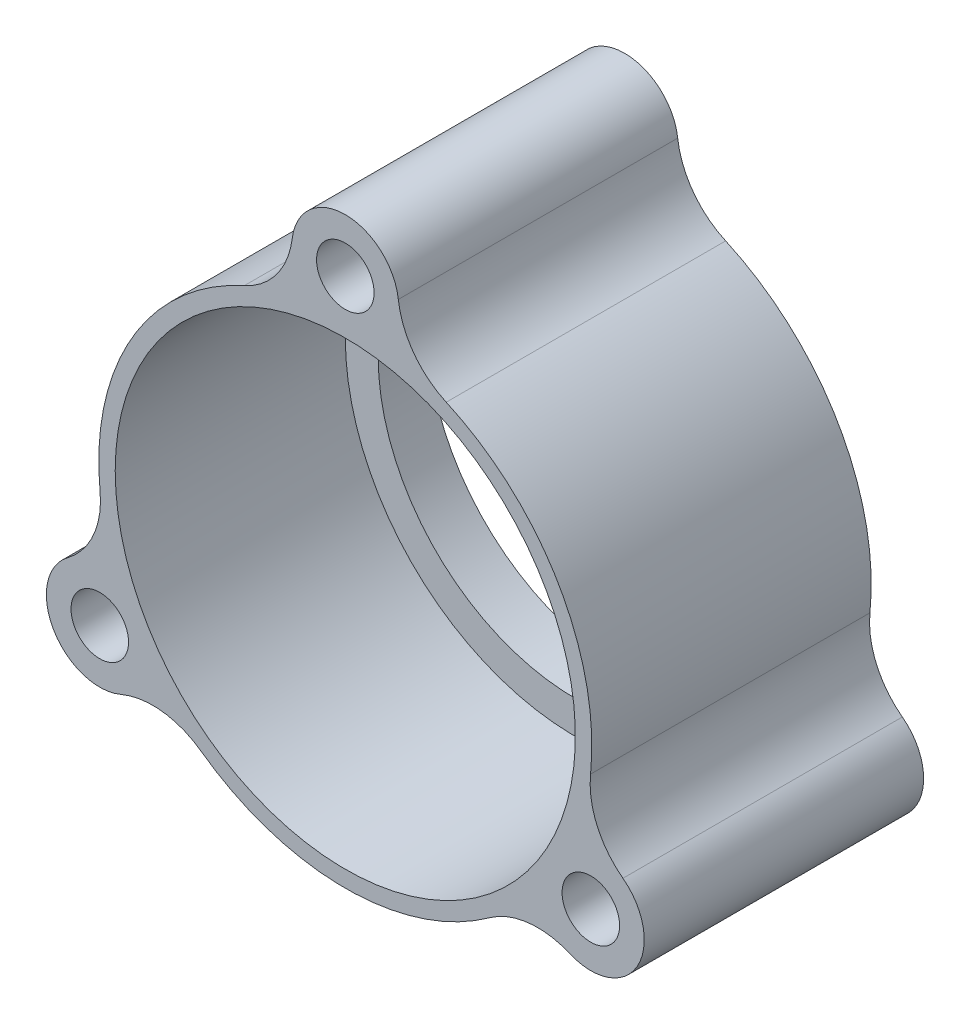
ISO-10303-21;
HEADER;
FILE_DESCRIPTION(('STEP AP214'),'2;1');
FILE_NAME('part.step','',(''),(''),'','','');
FILE_SCHEMA(('AUTOMOTIVE_DESIGN { 1 0 10303 214 1 1 1 1 }'));
ENDSEC;
DATA;
#1=APPLICATION_CONTEXT('core data for automotive mechanical design processes');
#2=APPLICATION_PROTOCOL_DEFINITION('international standard','automotive_design',2000,#1);
#3=PRODUCT_CONTEXT('',#1,'mechanical');
#4=PRODUCT('Part','Part','',(#3));
#5=PRODUCT_RELATED_PRODUCT_CATEGORY('part','',(#4));
#6=PRODUCT_DEFINITION_FORMATION('','',#4);
#7=PRODUCT_DEFINITION_CONTEXT('part definition',#1,'design');
#8=PRODUCT_DEFINITION('design','',#6,#7);
#9=PRODUCT_DEFINITION_SHAPE('','',#8);
#10=(LENGTH_UNIT() NAMED_UNIT(*) SI_UNIT(.MILLI.,.METRE.));
#11=(NAMED_UNIT(*) PLANE_ANGLE_UNIT() SI_UNIT($,.RADIAN.));
#12=(NAMED_UNIT(*) SI_UNIT($,.STERADIAN.) SOLID_ANGLE_UNIT());
#13=UNCERTAINTY_MEASURE_WITH_UNIT(LENGTH_MEASURE(1.E-05),#10,'distance_accuracy_value','');
#14=(GEOMETRIC_REPRESENTATION_CONTEXT(3) GLOBAL_UNCERTAINTY_ASSIGNED_CONTEXT((#13)) GLOBAL_UNIT_ASSIGNED_CONTEXT((#10,
#11,#12)) REPRESENTATION_CONTEXT('',''));
#15=CARTESIAN_POINT('',(0.,0.,0.));
#16=DIRECTION('',(0.,0.,1.));
#17=DIRECTION('',(1.,0.,0.));
#18=AXIS2_PLACEMENT_3D('',#15,#16,#17);
#19=CARTESIAN_POINT('',(0.,0.,14.));
#20=DIRECTION('',(0.,0.,-1.));
#21=DIRECTION('',(-1.,0.,0.));
#22=AXIS2_PLACEMENT_3D('',#19,#20,#21);
#23=CYLINDRICAL_SURFACE('',#22,15.);
#24=CARTESIAN_POINT('',(0.,0.,-3.));
#25=DIRECTION('',(0.,0.,-1.));
#26=DIRECTION('',(-1.,0.,0.));
#27=AXIS2_PLACEMENT_3D('',#24,#25,#26);
#28=CIRCLE('',#27,15.);
#29=CARTESIAN_POINT('',(-14.9224736219948,-1.52308272948988,-3.));
#30=VERTEX_POINT('',#29);
#31=CARTESIAN_POINT('',(-6.14220847519368,13.6847826086957,-3.));
#32=VERTEX_POINT('',#31);
#33=EDGE_CURVE('E147',#30,#32,#28,.T.);
#34=ORIENTED_EDGE('',*,*,#33,.F.);
#35=DIRECTION('',(0.,0.,-1.));
#36=VECTOR('',#35,1.);
#37=CARTESIAN_POINT('',(-14.9224736219948,-1.52308272948988,14.));
#38=LINE('',#37,#36);
#39=CARTESIAN_POINT('',(-14.9224736219948,-1.52308272948988,14.));
#40=VERTEX_POINT('',#39);
#41=EDGE_CURVE('E181',#30,#40,#38,.F.);
#42=ORIENTED_EDGE('',*,*,#41,.T.);
#43=CARTESIAN_POINT('',(0.,0.,14.));
#44=DIRECTION('',(0.,0.,1.));
#45=DIRECTION('',(1.,0.,0.));
#46=AXIS2_PLACEMENT_3D('',#43,#44,#45);
#47=CIRCLE('',#46,15.);
#48=CARTESIAN_POINT('',(-6.14220847519368,13.6847826086957,14.));
#49=VERTEX_POINT('',#48);
#50=EDGE_CURVE('E156',#49,#40,#47,.T.);
#51=ORIENTED_EDGE('',*,*,#50,.F.);
#52=DIRECTION('',(0.,0.,-1.));
#53=VECTOR('',#52,1.);
#54=CARTESIAN_POINT('',(-6.14220847519368,13.6847826086957,14.));
#55=LINE('',#54,#53);
#56=EDGE_CURVE('E151',#49,#32,#55,.T.);
#57=ORIENTED_EDGE('',*,*,#56,.T.);
#58=EDGE_LOOP('',(#34,#42,#51,#57));
#59=FACE_BOUND('',#58,.T.);
#60=ADVANCED_FACE('F33',(#59),#23,.T.);
#61=CARTESIAN_POINT('',(-8.78026514680119,-12.1616998792055,14.));
#62=VERTEX_POINT('',#61);
#63=CARTESIAN_POINT('',(8.78026514680102,-12.1616998792057,14.));
#64=VERTEX_POINT('',#63);
#65=EDGE_CURVE('E208',#62,#64,#47,.T.);
#66=ORIENTED_EDGE('',*,*,#65,.F.);
#67=DIRECTION('',(0.,0.,-1.));
#68=VECTOR('',#67,1.);
#69=CARTESIAN_POINT('',(-8.78026514680119,-12.1616998792055,14.));
#70=LINE('',#69,#68);
#71=CARTESIAN_POINT('',(-8.78026514680119,-12.1616998792055,-3.));
#72=VERTEX_POINT('',#71);
#73=EDGE_CURVE('E188',#62,#72,#70,.T.);
#74=ORIENTED_EDGE('',*,*,#73,.T.);
#75=CARTESIAN_POINT('',(8.78026514680102,-12.1616998792057,-3.));
#76=VERTEX_POINT('',#75);
#77=EDGE_CURVE('E145',#76,#72,#28,.T.);
#78=ORIENTED_EDGE('',*,*,#77,.F.);
#79=DIRECTION('',(0.,0.,-1.));
#80=VECTOR('',#79,1.);
#81=CARTESIAN_POINT('',(8.78026514680102,-12.1616998792057,14.));
#82=LINE('',#81,#80);
#83=EDGE_CURVE('E165',#76,#64,#82,.F.);
#84=ORIENTED_EDGE('',*,*,#83,.T.);
#85=EDGE_LOOP('',(#66,#74,#78,#84));
#86=FACE_BOUND('',#85,.T.);
#87=ADVANCED_FACE('F206',(#86),#23,.T.);
#88=CARTESIAN_POINT('',(14.9224736219947,-1.52308272949009,14.));
#89=VERTEX_POINT('',#88);
#90=CARTESIAN_POINT('',(6.14220847519368,13.6847826086957,14.));
#91=VERTEX_POINT('',#90);
#92=EDGE_CURVE('E210',#89,#91,#47,.T.);
#93=ORIENTED_EDGE('',*,*,#92,.F.);
#94=DIRECTION('',(0.,0.,-1.));
#95=VECTOR('',#94,1.);
#96=CARTESIAN_POINT('',(14.9224736219947,-1.52308272949009,14.));
#97=LINE('',#96,#95);
#98=CARTESIAN_POINT('',(14.9224736219947,-1.52308272949009,-3.));
#99=VERTEX_POINT('',#98);
#100=EDGE_CURVE('E143',#89,#99,#97,.T.);
#101=ORIENTED_EDGE('',*,*,#100,.T.);
#102=CARTESIAN_POINT('',(6.14220847519368,13.6847826086957,-3.));
#103=VERTEX_POINT('',#102);
#104=EDGE_CURVE('E127',#103,#99,#28,.T.);
#105=ORIENTED_EDGE('',*,*,#104,.F.);
#106=DIRECTION('',(0.,0.,-1.));
#107=VECTOR('',#106,1.);
#108=CARTESIAN_POINT('',(6.14220847519368,13.6847826086957,14.));
#109=LINE('',#108,#107);
#110=EDGE_CURVE('E141',#103,#91,#109,.F.);
#111=ORIENTED_EDGE('',*,*,#110,.T.);
#112=EDGE_LOOP('',(#93,#101,#105,#111));
#113=FACE_BOUND('',#112,.T.);
#114=ADVANCED_FACE('F140',(#113),#23,.T.);
#115=CARTESIAN_POINT('',(0.,0.,14.));
#116=DIRECTION('',(0.,0.,1.));
#117=DIRECTION('',(1.,0.,0.));
#118=AXIS2_PLACEMENT_3D('',#115,#116,#117);
#119=PLANE('',#118);
#120=ORIENTED_EDGE('',*,*,#50,.T.);
#121=CARTESIAN_POINT('',(-19.896631495993,-2.03077697265318,14.));
#122=DIRECTION('',(0.,0.,1.));
#123=DIRECTION('',(1.,0.,0.));
#124=AXIS2_PLACEMENT_3D('',#121,#122,#123);
#125=CIRCLE('',#124,5.);
#126=CARTESIAN_POINT('',(-16.8919689016225,-6.02727577710571,14.));
#127=VERTEX_POINT('',#126);
#128=EDGE_CURVE('E190',#40,#127,#125,.F.);
#129=ORIENTED_EDGE('',*,*,#128,.T.);
#130=CARTESIAN_POINT('',(-14.9389382152816,-8.62499999999986,14.));
#131=DIRECTION('',(0.,0.,1.));
#132=DIRECTION('',(-0.499999999999992,0.866025403784443,0.));
#133=AXIS2_PLACEMENT_3D('',#130,#131,#132);
#134=CIRCLE('',#133,3.25);
#135=CARTESIAN_POINT('',(-13.6657583893996,-11.6152363001887,14.));
#136=VERTEX_POINT('',#135);
#137=EDGE_CURVE('E249',#127,#136,#134,.T.);
#138=ORIENTED_EDGE('',*,*,#137,.T.);
#139=CARTESIAN_POINT('',(-11.7070201957349,-16.2155998389407,14.));
#140=DIRECTION('',(0.,0.,1.));
#141=DIRECTION('',(1.,0.,0.));
#142=AXIS2_PLACEMENT_3D('',#139,#140,#141);
#143=CIRCLE('',#142,5.);
#144=EDGE_CURVE('E11',#136,#62,#143,.F.);
#145=ORIENTED_EDGE('',*,*,#144,.T.);
#146=ORIENTED_EDGE('',*,*,#65,.T.);
#147=CARTESIAN_POINT('',(11.7070201957347,-16.2155998389409,14.));
#148=DIRECTION('',(0.,0.,1.));
#149=DIRECTION('',(1.,0.,0.));
#150=AXIS2_PLACEMENT_3D('',#147,#148,#149);
#151=CIRCLE('',#150,5.);
#152=CARTESIAN_POINT('',(13.6657583893994,-11.6152363001889,14.));
#153=VERTEX_POINT('',#152);
#154=EDGE_CURVE('E173',#64,#153,#151,.F.);
#155=ORIENTED_EDGE('',*,*,#154,.T.);
#156=CARTESIAN_POINT('',(14.9389382152815,-8.62500000000007,14.));
#157=DIRECTION('',(0.,0.,1.));
#158=DIRECTION('',(-0.500000000000004,-0.866025403784436,0.));
#159=AXIS2_PLACEMENT_3D('',#156,#157,#158);
#160=CIRCLE('',#159,3.25);
#161=CARTESIAN_POINT('',(16.8919689016224,-6.02727577710595,14.));
#162=VERTEX_POINT('',#161);
#163=EDGE_CURVE('E242',#153,#162,#160,.T.);
#164=ORIENTED_EDGE('',*,*,#163,.T.);
#165=CARTESIAN_POINT('',(19.896631495993,-2.03077697265345,14.));
#166=DIRECTION('',(0.,0.,1.));
#167=DIRECTION('',(1.,0.,0.));
#168=AXIS2_PLACEMENT_3D('',#165,#166,#167);
#169=CIRCLE('',#168,5.);
#170=EDGE_CURVE('E179',#162,#89,#169,.F.);
#171=ORIENTED_EDGE('',*,*,#170,.T.);
#172=ORIENTED_EDGE('',*,*,#92,.T.);
#173=CARTESIAN_POINT('',(8.18961130025824,18.2463768115942,14.));
#174=DIRECTION('',(0.,0.,1.));
#175=DIRECTION('',(1.,0.,0.));
#176=AXIS2_PLACEMENT_3D('',#173,#174,#175);
#177=CIRCLE('',#176,5.);
#178=CARTESIAN_POINT('',(3.22621051222294,17.6425120772947,14.));
#179=VERTEX_POINT('',#178);
#180=EDGE_CURVE('E134',#91,#179,#177,.F.);
#181=ORIENTED_EDGE('',*,*,#180,.T.);
#182=CARTESIAN_POINT('',(0.,17.25,14.));
#183=DIRECTION('',(0.,0.,1.));
#184=DIRECTION('',(1.,0.,0.));
#185=AXIS2_PLACEMENT_3D('',#182,#183,#184);
#186=CIRCLE('',#185,3.25);
#187=CARTESIAN_POINT('',(-3.22621051222294,17.6425120772947,14.));
#188=VERTEX_POINT('',#187);
#189=EDGE_CURVE('E230',#179,#188,#186,.T.);
#190=ORIENTED_EDGE('',*,*,#189,.T.);
#191=CARTESIAN_POINT('',(-8.18961130025824,18.2463768115942,14.));
#192=DIRECTION('',(0.,0.,1.));
#193=DIRECTION('',(1.,0.,0.));
#194=AXIS2_PLACEMENT_3D('',#191,#192,#193);
#195=CIRCLE('',#194,5.);
#196=EDGE_CURVE('E163',#188,#49,#195,.F.);
#197=ORIENTED_EDGE('',*,*,#196,.T.);
#198=EDGE_LOOP('',(#120,#129,#138,#145,#146,#155,#164,#171,#172,#181,#190,#197));
#199=FACE_BOUND('',#198,.T.);
#200=CARTESIAN_POINT('',(0.,0.,14.));
#201=DIRECTION('',(0.,0.,-1.));
#202=DIRECTION('',(-1.,0.,0.));
#203=AXIS2_PLACEMENT_3D('',#200,#201,#202);
#204=CIRCLE('',#203,14.);
#205=CARTESIAN_POINT('',(-14.,0.,14.));
#206=VERTEX_POINT('',#205);
#207=EDGE_CURVE('E212',#206,#206,#204,.T.);
#208=ORIENTED_EDGE('',*,*,#207,.T.);
#209=EDGE_LOOP('',(#208));
#210=FACE_BOUND('',#209,.T.);
#211=CARTESIAN_POINT('',(0.,17.25,14.));
#212=DIRECTION('',(0.,0.,1.));
#213=DIRECTION('',(1.,0.,0.));
#214=AXIS2_PLACEMENT_3D('',#211,#212,#213);
#215=CIRCLE('',#214,1.75);
#216=CARTESIAN_POINT('',(1.75,17.25,14.));
#217=VERTEX_POINT('',#216);
#218=EDGE_CURVE('E226',#217,#217,#215,.T.);
#219=ORIENTED_EDGE('',*,*,#218,.F.);
#220=EDGE_LOOP('',(#219));
#221=FACE_BOUND('',#220,.T.);
#222=CARTESIAN_POINT('',(14.9389382152815,-8.62500000000007,14.));
#223=DIRECTION('',(0.,0.,1.));
#224=DIRECTION('',(-0.500000000000004,-0.866025403784436,0.));
#225=AXIS2_PLACEMENT_3D('',#222,#223,#224);
#226=CIRCLE('',#225,1.75);
#227=CARTESIAN_POINT('',(14.0639382152815,-10.1405444566228,14.));
#228=VERTEX_POINT('',#227);
#229=EDGE_CURVE('E238',#228,#228,#226,.T.);
#230=ORIENTED_EDGE('',*,*,#229,.F.);
#231=EDGE_LOOP('',(#230));
#232=FACE_BOUND('',#231,.T.);
#233=CARTESIAN_POINT('',(-14.9389382152816,-8.62499999999986,14.));
#234=DIRECTION('',(0.,0.,1.));
#235=DIRECTION('',(-0.499999999999992,0.866025403784443,0.));
#236=AXIS2_PLACEMENT_3D('',#233,#234,#235);
#237=CIRCLE('',#236,1.75);
#238=CARTESIAN_POINT('',(-15.8139382152816,-7.10945554337708,14.));
#239=VERTEX_POINT('',#238);
#240=EDGE_CURVE('E203',#239,#239,#237,.T.);
#241=ORIENTED_EDGE('',*,*,#240,.F.);
#242=EDGE_LOOP('',(#241));
#243=FACE_BOUND('',#242,.T.);
#244=ADVANCED_FACE('F252',(#199,#210,#221,#232,#243),#119,.T.);
#245=CARTESIAN_POINT('',(0.,0.,14.));
#246=DIRECTION('',(0.,0.,-1.));
#247=DIRECTION('',(-1.,0.,0.));
#248=AXIS2_PLACEMENT_3D('',#245,#246,#247);
#249=CYLINDRICAL_SURFACE('',#248,14.);
#250=ORIENTED_EDGE('',*,*,#207,.F.);
#251=EDGE_LOOP('',(#250));
#252=FACE_BOUND('',#251,.T.);
#253=CARTESIAN_POINT('',(0.,0.,0.));
#254=DIRECTION('',(0.,0.,-1.));
#255=DIRECTION('',(-1.,0.,0.));
#256=AXIS2_PLACEMENT_3D('',#253,#254,#255);
#257=CIRCLE('',#256,14.);
#258=CARTESIAN_POINT('',(-14.,0.,0.));
#259=VERTEX_POINT('',#258);
#260=EDGE_CURVE('E144',#259,#259,#257,.F.);
#261=ORIENTED_EDGE('',*,*,#260,.F.);
#262=EDGE_LOOP('',(#261));
#263=FACE_BOUND('',#262,.T.);
#264=ADVANCED_FACE('F302',(#252,#263),#249,.F.);
#265=CARTESIAN_POINT('',(0.,0.,0.));
#266=DIRECTION('',(0.,0.,-1.));
#267=DIRECTION('',(-1.,0.,0.));
#268=AXIS2_PLACEMENT_3D('',#265,#266,#267);
#269=PLANE('',#268);
#270=CARTESIAN_POINT('',(0.,0.,0.));
#271=DIRECTION('',(0.,0.,-1.));
#272=DIRECTION('',(-1.,0.,0.));
#273=AXIS2_PLACEMENT_3D('',#270,#271,#272);
#274=CIRCLE('',#273,12.);
#275=CARTESIAN_POINT('',(-12.,0.,0.));
#276=VERTEX_POINT('',#275);
#277=EDGE_CURVE('E218',#276,#276,#274,.T.);
#278=ORIENTED_EDGE('',*,*,#277,.T.);
#279=EDGE_LOOP('',(#278));
#280=FACE_BOUND('',#279,.T.);
#281=ORIENTED_EDGE('',*,*,#260,.T.);
#282=EDGE_LOOP('',(#281));
#283=FACE_BOUND('',#282,.T.);
#284=ADVANCED_FACE('F306',(#280,#283),#269,.F.);
#285=CARTESIAN_POINT('',(0.,0.,-3.));
#286=DIRECTION('',(0.,0.,-1.));
#287=DIRECTION('',(-1.,0.,0.));
#288=AXIS2_PLACEMENT_3D('',#285,#286,#287);
#289=PLANE('',#288);
#290=CARTESIAN_POINT('',(14.9389382152815,-8.62500000000007,-3.));
#291=DIRECTION('',(0.,0.,-1.));
#292=DIRECTION('',(-1.,0.,0.));
#293=AXIS2_PLACEMENT_3D('',#290,#291,#292);
#294=CIRCLE('',#293,3.25);
#295=CARTESIAN_POINT('',(13.6657583893994,-11.6152363001889,-3.));
#296=VERTEX_POINT('',#295);
#297=CARTESIAN_POINT('',(16.8919689016224,-6.02727577710595,-3.));
#298=VERTEX_POINT('',#297);
#299=EDGE_CURVE('E235',#296,#298,#294,.F.);
#300=ORIENTED_EDGE('',*,*,#299,.F.);
#301=CARTESIAN_POINT('',(11.7070201957347,-16.2155998389409,-3.));
#302=DIRECTION('',(0.,0.,-1.));
#303=DIRECTION('',(-1.,0.,0.));
#304=AXIS2_PLACEMENT_3D('',#301,#302,#303);
#305=CIRCLE('',#304,5.);
#306=EDGE_CURVE('E175',#296,#76,#305,.F.);
#307=ORIENTED_EDGE('',*,*,#306,.T.);
#308=ORIENTED_EDGE('',*,*,#77,.T.);
#309=CARTESIAN_POINT('',(-11.7070201957349,-16.2155998389407,-3.));
#310=DIRECTION('',(0.,0.,-1.));
#311=DIRECTION('',(-1.,0.,0.));
#312=AXIS2_PLACEMENT_3D('',#309,#310,#311);
#313=CIRCLE('',#312,5.);
#314=CARTESIAN_POINT('',(-13.6657583893996,-11.6152363001887,-3.));
#315=VERTEX_POINT('',#314);
#316=EDGE_CURVE('E41',#72,#315,#313,.F.);
#317=ORIENTED_EDGE('',*,*,#316,.T.);
#318=CARTESIAN_POINT('',(-14.9389382152816,-8.62499999999986,-3.));
#319=DIRECTION('',(0.,0.,-1.));
#320=DIRECTION('',(-1.,0.,0.));
#321=AXIS2_PLACEMENT_3D('',#318,#319,#320);
#322=CIRCLE('',#321,3.25);
#323=CARTESIAN_POINT('',(-16.8919689016225,-6.02727577710571,-3.));
#324=VERTEX_POINT('',#323);
#325=EDGE_CURVE('E196',#324,#315,#322,.F.);
#326=ORIENTED_EDGE('',*,*,#325,.F.);
#327=CARTESIAN_POINT('',(-19.896631495993,-2.03077697265318,-3.));
#328=DIRECTION('',(0.,0.,-1.));
#329=DIRECTION('',(-1.,0.,0.));
#330=AXIS2_PLACEMENT_3D('',#327,#328,#329);
#331=CIRCLE('',#330,5.);
#332=EDGE_CURVE('E192',#324,#30,#331,.F.);
#333=ORIENTED_EDGE('',*,*,#332,.T.);
#334=ORIENTED_EDGE('',*,*,#33,.T.);
#335=CARTESIAN_POINT('',(-8.18961130025824,18.2463768115942,-3.));
#336=DIRECTION('',(0.,0.,-1.));
#337=DIRECTION('',(-1.,0.,0.));
#338=AXIS2_PLACEMENT_3D('',#335,#336,#337);
#339=CIRCLE('',#338,5.);
#340=CARTESIAN_POINT('',(-3.22621051222294,17.6425120772947,-3.));
#341=VERTEX_POINT('',#340);
#342=EDGE_CURVE('E133',#32,#341,#339,.F.);
#343=ORIENTED_EDGE('',*,*,#342,.T.);
#344=CARTESIAN_POINT('',(0.,17.25,-3.));
#345=DIRECTION('',(0.,0.,-1.));
#346=DIRECTION('',(-1.,0.,0.));
#347=AXIS2_PLACEMENT_3D('',#344,#345,#346);
#348=CIRCLE('',#347,3.25);
#349=CARTESIAN_POINT('',(3.22621051222294,17.6425120772947,-3.));
#350=VERTEX_POINT('',#349);
#351=EDGE_CURVE('E129',#350,#341,#348,.F.);
#352=ORIENTED_EDGE('',*,*,#351,.F.);
#353=CARTESIAN_POINT('',(8.18961130025824,18.2463768115942,-3.));
#354=DIRECTION('',(0.,0.,-1.));
#355=DIRECTION('',(-1.,0.,0.));
#356=AXIS2_PLACEMENT_3D('',#353,#354,#355);
#357=CIRCLE('',#356,5.);
#358=EDGE_CURVE('E122',#350,#103,#357,.F.);
#359=ORIENTED_EDGE('',*,*,#358,.T.);
#360=ORIENTED_EDGE('',*,*,#104,.T.);
#361=CARTESIAN_POINT('',(19.896631495993,-2.03077697265345,-3.));
#362=DIRECTION('',(0.,0.,-1.));
#363=DIRECTION('',(-1.,0.,0.));
#364=AXIS2_PLACEMENT_3D('',#361,#362,#363);
#365=CIRCLE('',#364,5.);
#366=EDGE_CURVE('E177',#99,#298,#365,.F.);
#367=ORIENTED_EDGE('',*,*,#366,.T.);
#368=EDGE_LOOP('',(#300,#307,#308,#317,#326,#333,#334,#343,#352,#359,#360,#367));
#369=FACE_BOUND('',#368,.T.);
#370=CARTESIAN_POINT('',(0.,0.,-3.));
#371=DIRECTION('',(0.,0.,-1.));
#372=DIRECTION('',(-1.,0.,0.));
#373=AXIS2_PLACEMENT_3D('',#370,#371,#372);
#374=CIRCLE('',#373,12.);
#375=CARTESIAN_POINT('',(-12.,0.,-3.));
#376=VERTEX_POINT('',#375);
#377=EDGE_CURVE('E221',#376,#376,#374,.T.);
#378=ORIENTED_EDGE('',*,*,#377,.F.);
#379=EDGE_LOOP('',(#378));
#380=FACE_BOUND('',#379,.T.);
#381=CARTESIAN_POINT('',(0.,17.25,-3.));
#382=DIRECTION('',(0.,0.,-1.));
#383=DIRECTION('',(-1.,0.,0.));
#384=AXIS2_PLACEMENT_3D('',#381,#382,#383);
#385=CIRCLE('',#384,1.75);
#386=CARTESIAN_POINT('',(-1.75,17.25,-3.));
#387=VERTEX_POINT('',#386);
#388=EDGE_CURVE('E222',#387,#387,#385,.F.);
#389=ORIENTED_EDGE('',*,*,#388,.T.);
#390=EDGE_LOOP('',(#389));
#391=FACE_BOUND('',#390,.T.);
#392=CARTESIAN_POINT('',(14.9389382152815,-8.62500000000007,-3.));
#393=DIRECTION('',(0.,0.,-1.));
#394=DIRECTION('',(-1.,0.,0.));
#395=AXIS2_PLACEMENT_3D('',#392,#393,#394);
#396=CIRCLE('',#395,1.75);
#397=CARTESIAN_POINT('',(13.1889382152815,-8.62500000000007,-3.));
#398=VERTEX_POINT('',#397);
#399=EDGE_CURVE('E227',#398,#398,#396,.F.);
#400=ORIENTED_EDGE('',*,*,#399,.T.);
#401=EDGE_LOOP('',(#400));
#402=FACE_BOUND('',#401,.T.);
#403=CARTESIAN_POINT('',(-14.9389382152816,-8.62499999999986,-3.));
#404=DIRECTION('',(0.,0.,-1.));
#405=DIRECTION('',(-1.,0.,0.));
#406=AXIS2_PLACEMENT_3D('',#403,#404,#405);
#407=CIRCLE('',#406,1.75);
#408=CARTESIAN_POINT('',(-16.6889382152816,-8.62499999999986,-3.));
#409=VERTEX_POINT('',#408);
#410=EDGE_CURVE('E239',#409,#409,#407,.F.);
#411=ORIENTED_EDGE('',*,*,#410,.T.);
#412=EDGE_LOOP('',(#411));
#413=FACE_BOUND('',#412,.T.);
#414=ADVANCED_FACE('F125',(#369,#380,#391,#402,#413),#289,.T.);
#415=CARTESIAN_POINT('',(0.,0.,-3.));
#416=DIRECTION('',(0.,0.,1.));
#417=DIRECTION('',(1.,0.,0.));
#418=AXIS2_PLACEMENT_3D('',#415,#416,#417);
#419=CYLINDRICAL_SURFACE('',#418,12.);
#420=ORIENTED_EDGE('',*,*,#377,.T.);
#421=EDGE_LOOP('',(#420));
#422=FACE_BOUND('',#421,.T.);
#423=ORIENTED_EDGE('',*,*,#277,.F.);
#424=EDGE_LOOP('',(#423));
#425=FACE_BOUND('',#424,.T.);
#426=ADVANCED_FACE('F315',(#422,#425),#419,.F.);
#427=CARTESIAN_POINT('',(0.,17.25,-12.1923881554251));
#428=DIRECTION('',(0.,0.,1.));
#429=DIRECTION('',(1.,0.,0.));
#430=AXIS2_PLACEMENT_3D('',#427,#428,#429);
#431=CYLINDRICAL_SURFACE('',#430,3.25);
#432=ORIENTED_EDGE('',*,*,#189,.F.);
#433=DIRECTION('',(0.,0.,1.));
#434=VECTOR('',#433,1.);
#435=CARTESIAN_POINT('',(3.22621051222294,17.6425120772947,-12.1923881554251));
#436=LINE('',#435,#434);
#437=EDGE_CURVE('E153',#179,#350,#436,.F.);
#438=ORIENTED_EDGE('',*,*,#437,.T.);
#439=ORIENTED_EDGE('',*,*,#351,.T.);
#440=DIRECTION('',(0.,0.,1.));
#441=VECTOR('',#440,1.);
#442=CARTESIAN_POINT('',(-3.22621051222294,17.6425120772947,-12.1923881554251));
#443=LINE('',#442,#441);
#444=EDGE_CURVE('E150',#341,#188,#443,.T.);
#445=ORIENTED_EDGE('',*,*,#444,.T.);
#446=EDGE_LOOP('',(#432,#438,#439,#445));
#447=FACE_BOUND('',#446,.T.);
#448=ADVANCED_FACE('F268',(#447),#431,.T.);
#449=CARTESIAN_POINT('',(0.,17.25,-12.1923881554251));
#450=DIRECTION('',(0.,0.,1.));
#451=DIRECTION('',(1.,0.,0.));
#452=AXIS2_PLACEMENT_3D('',#449,#450,#451);
#453=CYLINDRICAL_SURFACE('',#452,1.75);
#454=ORIENTED_EDGE('',*,*,#218,.T.);
#455=EDGE_LOOP('',(#454));
#456=FACE_BOUND('',#455,.T.);
#457=ORIENTED_EDGE('',*,*,#388,.F.);
#458=EDGE_LOOP('',(#457));
#459=FACE_BOUND('',#458,.T.);
#460=ADVANCED_FACE('F319',(#456,#459),#453,.F.);
#461=CARTESIAN_POINT('',(8.18961130025824,18.2463768115942,-12.1923881554251));
#462=DIRECTION('',(0.,0.,-1.));
#463=DIRECTION('',(-1.,0.,0.));
#464=AXIS2_PLACEMENT_3D('',#461,#462,#463);
#465=CYLINDRICAL_SURFACE('',#464,5.);
#466=ORIENTED_EDGE('',*,*,#358,.F.);
#467=ORIENTED_EDGE('',*,*,#437,.F.);
#468=ORIENTED_EDGE('',*,*,#180,.F.);
#469=ORIENTED_EDGE('',*,*,#110,.F.);
#470=EDGE_LOOP('',(#466,#467,#468,#469));
#471=FACE_BOUND('',#470,.T.);
#472=ADVANCED_FACE('F149',(#471),#465,.F.);
#473=CARTESIAN_POINT('',(-8.18961130025824,18.2463768115942,-12.1923881554251));
#474=DIRECTION('',(0.,0.,1.));
#475=DIRECTION('',(1.,0.,0.));
#476=AXIS2_PLACEMENT_3D('',#473,#474,#475);
#477=CYLINDRICAL_SURFACE('',#476,5.);
#478=ORIENTED_EDGE('',*,*,#196,.F.);
#479=ORIENTED_EDGE('',*,*,#444,.F.);
#480=ORIENTED_EDGE('',*,*,#342,.F.);
#481=ORIENTED_EDGE('',*,*,#56,.F.);
#482=EDGE_LOOP('',(#478,#479,#480,#481));
#483=FACE_BOUND('',#482,.T.);
#484=ADVANCED_FACE('F264',(#483),#477,.F.);
#485=CARTESIAN_POINT('',(14.9389382152815,-8.62500000000007,-12.1923881554251));
#486=DIRECTION('',(0.,0.,1.));
#487=DIRECTION('',(1.,0.,0.));
#488=AXIS2_PLACEMENT_3D('',#485,#486,#487);
#489=CYLINDRICAL_SURFACE('',#488,3.25);
#490=ORIENTED_EDGE('',*,*,#163,.F.);
#491=DIRECTION('',(0.,0.,1.));
#492=VECTOR('',#491,1.);
#493=CARTESIAN_POINT('',(13.6657583893994,-11.6152363001889,-12.1923881554251));
#494=LINE('',#493,#492);
#495=EDGE_CURVE('E170',#153,#296,#494,.F.);
#496=ORIENTED_EDGE('',*,*,#495,.T.);
#497=ORIENTED_EDGE('',*,*,#299,.T.);
#498=DIRECTION('',(0.,0.,1.));
#499=VECTOR('',#498,1.);
#500=CARTESIAN_POINT('',(16.8919689016224,-6.02727577710595,-12.1923881554251));
#501=LINE('',#500,#499);
#502=EDGE_CURVE('E168',#298,#162,#501,.T.);
#503=ORIENTED_EDGE('',*,*,#502,.T.);
#504=EDGE_LOOP('',(#490,#496,#497,#503));
#505=FACE_BOUND('',#504,.T.);
#506=ADVANCED_FACE('F276',(#505),#489,.T.);
#507=CARTESIAN_POINT('',(14.9389382152815,-8.62500000000007,-12.1923881554251));
#508=DIRECTION('',(0.,0.,1.));
#509=DIRECTION('',(1.,0.,0.));
#510=AXIS2_PLACEMENT_3D('',#507,#508,#509);
#511=CYLINDRICAL_SURFACE('',#510,1.75);
#512=ORIENTED_EDGE('',*,*,#229,.T.);
#513=EDGE_LOOP('',(#512));
#514=FACE_BOUND('',#513,.T.);
#515=ORIENTED_EDGE('',*,*,#399,.F.);
#516=EDGE_LOOP('',(#515));
#517=FACE_BOUND('',#516,.T.);
#518=ADVANCED_FACE('F325',(#514,#517),#511,.F.);
#519=CARTESIAN_POINT('',(-14.9389382152816,-8.62499999999986,-12.1923881554251));
#520=DIRECTION('',(0.,0.,1.));
#521=DIRECTION('',(1.,0.,0.));
#522=AXIS2_PLACEMENT_3D('',#519,#520,#521);
#523=CYLINDRICAL_SURFACE('',#522,3.25);
#524=ORIENTED_EDGE('',*,*,#137,.F.);
#525=DIRECTION('',(0.,0.,1.));
#526=VECTOR('',#525,1.);
#527=CARTESIAN_POINT('',(-16.8919689016225,-6.02727577710571,-12.1923881554251));
#528=LINE('',#527,#526);
#529=EDGE_CURVE('E186',#127,#324,#528,.F.);
#530=ORIENTED_EDGE('',*,*,#529,.T.);
#531=ORIENTED_EDGE('',*,*,#325,.T.);
#532=DIRECTION('',(0.,0.,1.));
#533=VECTOR('',#532,1.);
#534=CARTESIAN_POINT('',(-13.6657583893996,-11.6152363001887,-12.1923881554251));
#535=LINE('',#534,#533);
#536=EDGE_CURVE('E184',#315,#136,#535,.T.);
#537=ORIENTED_EDGE('',*,*,#536,.T.);
#538=EDGE_LOOP('',(#524,#530,#531,#537));
#539=FACE_BOUND('',#538,.T.);
#540=ADVANCED_FACE('F201',(#539),#523,.T.);
#541=CARTESIAN_POINT('',(-14.9389382152816,-8.62499999999986,-12.1923881554251));
#542=DIRECTION('',(0.,0.,1.));
#543=DIRECTION('',(1.,0.,0.));
#544=AXIS2_PLACEMENT_3D('',#541,#542,#543);
#545=CYLINDRICAL_SURFACE('',#544,1.75);
#546=ORIENTED_EDGE('',*,*,#240,.T.);
#547=EDGE_LOOP('',(#546));
#548=FACE_BOUND('',#547,.T.);
#549=ORIENTED_EDGE('',*,*,#410,.F.);
#550=EDGE_LOOP('',(#549));
#551=FACE_BOUND('',#550,.T.);
#552=ADVANCED_FACE('F281',(#548,#551),#545,.F.);
#553=CARTESIAN_POINT('',(11.7070201957347,-16.2155998389409,-12.1923881554251));
#554=DIRECTION('',(0.,0.,-1.));
#555=DIRECTION('',(-1.,0.,0.));
#556=AXIS2_PLACEMENT_3D('',#553,#554,#555);
#557=CYLINDRICAL_SURFACE('',#556,5.);
#558=ORIENTED_EDGE('',*,*,#306,.F.);
#559=ORIENTED_EDGE('',*,*,#495,.F.);
#560=ORIENTED_EDGE('',*,*,#154,.F.);
#561=ORIENTED_EDGE('',*,*,#83,.F.);
#562=EDGE_LOOP('',(#558,#559,#560,#561));
#563=FACE_BOUND('',#562,.T.);
#564=ADVANCED_FACE('F279',(#563),#557,.F.);
#565=CARTESIAN_POINT('',(19.896631495993,-2.03077697265345,-12.1923881554251));
#566=DIRECTION('',(0.,0.,1.));
#567=DIRECTION('',(1.,0.,0.));
#568=AXIS2_PLACEMENT_3D('',#565,#566,#567);
#569=CYLINDRICAL_SURFACE('',#568,5.);
#570=ORIENTED_EDGE('',*,*,#170,.F.);
#571=ORIENTED_EDGE('',*,*,#502,.F.);
#572=ORIENTED_EDGE('',*,*,#366,.F.);
#573=ORIENTED_EDGE('',*,*,#100,.F.);
#574=EDGE_LOOP('',(#570,#571,#572,#573));
#575=FACE_BOUND('',#574,.T.);
#576=ADVANCED_FACE('F271',(#575),#569,.F.);
#577=CARTESIAN_POINT('',(-19.896631495993,-2.03077697265318,-12.1923881554251));
#578=DIRECTION('',(0.,0.,-1.));
#579=DIRECTION('',(-1.,0.,0.));
#580=AXIS2_PLACEMENT_3D('',#577,#578,#579);
#581=CYLINDRICAL_SURFACE('',#580,5.);
#582=ORIENTED_EDGE('',*,*,#332,.F.);
#583=ORIENTED_EDGE('',*,*,#529,.F.);
#584=ORIENTED_EDGE('',*,*,#128,.F.);
#585=ORIENTED_EDGE('',*,*,#41,.F.);
#586=EDGE_LOOP('',(#582,#583,#584,#585));
#587=FACE_BOUND('',#586,.T.);
#588=ADVANCED_FACE('F255',(#587),#581,.F.);
#589=CARTESIAN_POINT('',(-11.7070201957349,-16.2155998389407,-12.1923881554251));
#590=DIRECTION('',(0.,0.,1.));
#591=DIRECTION('',(1.,0.,0.));
#592=AXIS2_PLACEMENT_3D('',#589,#590,#591);
#593=CYLINDRICAL_SURFACE('',#592,5.);
#594=ORIENTED_EDGE('',*,*,#144,.F.);
#595=ORIENTED_EDGE('',*,*,#536,.F.);
#596=ORIENTED_EDGE('',*,*,#316,.F.);
#597=ORIENTED_EDGE('',*,*,#73,.F.);
#598=EDGE_LOOP('',(#594,#595,#596,#597));
#599=FACE_BOUND('',#598,.T.);
#600=ADVANCED_FACE('F35',(#599),#593,.F.);
#601=CLOSED_SHELL('',(#60,#87,#114,#244,#264,#284,#414,#426,#448,#460,#472,#484,#506,#518,#540,
#552,#564,#576,#588,#600));
#602=MANIFOLD_SOLID_BREP('B2',#601);
#603=ADVANCED_BREP_SHAPE_REPRESENTATION('',(#18,#602),#14);
#604=SHAPE_DEFINITION_REPRESENTATION(#9,#603);
ENDSEC;
END-ISO-10303-21;
